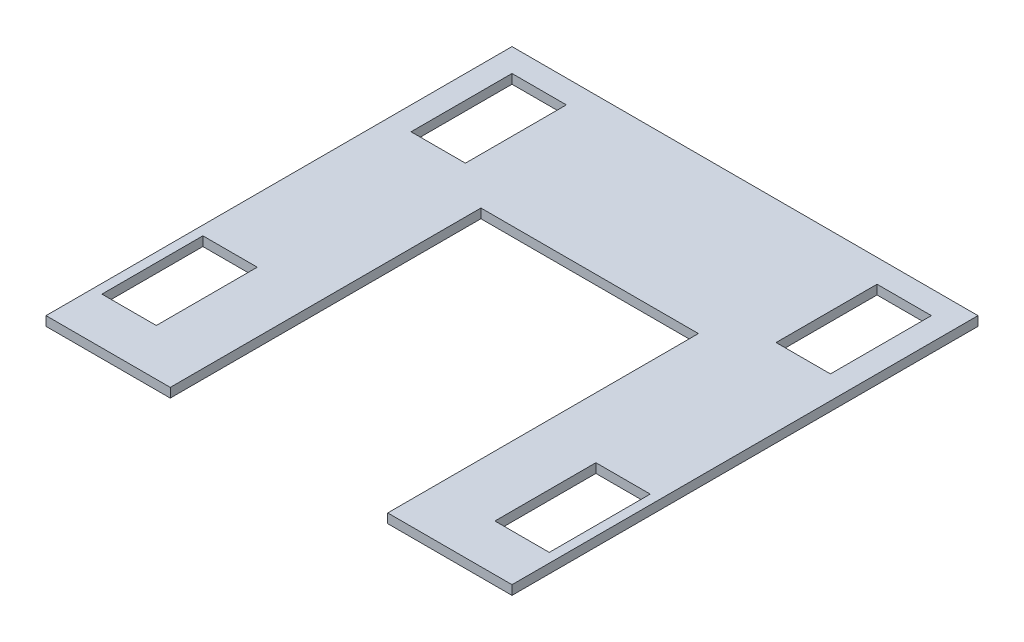
ISO-10303-21;
HEADER;
FILE_DESCRIPTION(('STEP AP214'),'2;1');
FILE_NAME('part.step','',(''),(''),'','','');
FILE_SCHEMA(('AUTOMOTIVE_DESIGN { 1 0 10303 214 1 1 1 1 }'));
ENDSEC;
DATA;
#1=APPLICATION_CONTEXT('core data for automotive mechanical design processes');
#2=APPLICATION_PROTOCOL_DEFINITION('international standard','automotive_design',2000,#1);
#3=PRODUCT_CONTEXT('',#1,'mechanical');
#4=PRODUCT('Part','Part','',(#3));
#5=PRODUCT_RELATED_PRODUCT_CATEGORY('part','',(#4));
#6=PRODUCT_DEFINITION_FORMATION('','',#4);
#7=PRODUCT_DEFINITION_CONTEXT('part definition',#1,'design');
#8=PRODUCT_DEFINITION('design','',#6,#7);
#9=PRODUCT_DEFINITION_SHAPE('','',#8);
#10=(LENGTH_UNIT() NAMED_UNIT(*) SI_UNIT(.MILLI.,.METRE.));
#11=(NAMED_UNIT(*) PLANE_ANGLE_UNIT() SI_UNIT($,.RADIAN.));
#12=(NAMED_UNIT(*) SI_UNIT($,.STERADIAN.) SOLID_ANGLE_UNIT());
#13=UNCERTAINTY_MEASURE_WITH_UNIT(LENGTH_MEASURE(1.E-05),#10,'distance_accuracy_value','');
#14=(GEOMETRIC_REPRESENTATION_CONTEXT(3) GLOBAL_UNCERTAINTY_ASSIGNED_CONTEXT((#13)) GLOBAL_UNIT_ASSIGNED_CONTEXT((#10,
#11,#12)) REPRESENTATION_CONTEXT('',''));
#15=CARTESIAN_POINT('',(0.,0.,0.));
#16=DIRECTION('',(0.,0.,1.));
#17=DIRECTION('',(1.,0.,0.));
#18=AXIS2_PLACEMENT_3D('',#15,#16,#17);
#19=CARTESIAN_POINT('',(0.,6.,0.));
#20=DIRECTION('',(0.,-1.,0.));
#21=DIRECTION('',(0.,0.,-1.));
#22=AXIS2_PLACEMENT_3D('',#19,#20,#21);
#23=PLANE('',#22);
#24=DIRECTION('',(0.,0.,1.));
#25=VECTOR('',#24,1.);
#26=CARTESIAN_POINT('',(6.,6.,-30.));
#27=LINE('',#26,#25);
#28=CARTESIAN_POINT('',(5.99999999999999,6.,-95.));
#29=VERTEX_POINT('',#28);
#30=CARTESIAN_POINT('',(6.,6.,-30.));
#31=VERTEX_POINT('',#30);
#32=EDGE_CURVE('E233',#29,#31,#27,.T.);
#33=ORIENTED_EDGE('',*,*,#32,.F.);
#34=DIRECTION('',(-1.,0.,0.));
#35=VECTOR('',#34,1.);
#36=CARTESIAN_POINT('',(5.99999999999999,6.,-95.));
#37=LINE('',#36,#35);
#38=CARTESIAN_POINT('',(41.,6.,-95.));
#39=VERTEX_POINT('',#38);
#40=EDGE_CURVE('E241',#39,#29,#37,.T.);
#41=ORIENTED_EDGE('',*,*,#40,.F.);
#42=DIRECTION('',(0.,0.,-1.));
#43=VECTOR('',#42,1.);
#44=CARTESIAN_POINT('',(41.,6.,-30.));
#45=LINE('',#44,#43);
#46=CARTESIAN_POINT('',(41.,6.,-30.));
#47=VERTEX_POINT('',#46);
#48=EDGE_CURVE('E238',#47,#39,#45,.T.);
#49=ORIENTED_EDGE('',*,*,#48,.F.);
#50=DIRECTION('',(1.,0.,0.));
#51=VECTOR('',#50,1.);
#52=CARTESIAN_POINT('',(6.,6.,-30.));
#53=LINE('',#52,#51);
#54=EDGE_CURVE('E235',#31,#47,#53,.T.);
#55=ORIENTED_EDGE('',*,*,#54,.F.);
#56=EDGE_LOOP('',(#33,#41,#49,#55));
#57=FACE_BOUND('',#56,.T.);
#58=DIRECTION('',(0.,0.,1.));
#59=VECTOR('',#58,1.);
#60=CARTESIAN_POINT('',(15.,6.,-285.));
#61=LINE('',#60,#59);
#62=CARTESIAN_POINT('',(15.,6.,-285.));
#63=VERTEX_POINT('',#62);
#64=CARTESIAN_POINT('',(15.,6.,-220.));
#65=VERTEX_POINT('',#64);
#66=EDGE_CURVE('E295',#63,#65,#61,.T.);
#67=ORIENTED_EDGE('',*,*,#66,.F.);
#68=DIRECTION('',(-1.,0.,0.));
#69=VECTOR('',#68,1.);
#70=CARTESIAN_POINT('',(15.,6.,-285.));
#71=LINE('',#70,#69);
#72=CARTESIAN_POINT('',(50.,6.,-285.));
#73=VERTEX_POINT('',#72);
#74=EDGE_CURVE('E303',#73,#63,#71,.T.);
#75=ORIENTED_EDGE('',*,*,#74,.F.);
#76=DIRECTION('',(0.,0.,-1.));
#77=VECTOR('',#76,1.);
#78=CARTESIAN_POINT('',(50.,6.,-285.));
#79=LINE('',#78,#77);
#80=CARTESIAN_POINT('',(50.,6.,-220.));
#81=VERTEX_POINT('',#80);
#82=EDGE_CURVE('E300',#81,#73,#79,.T.);
#83=ORIENTED_EDGE('',*,*,#82,.F.);
#84=DIRECTION('',(1.,0.,0.));
#85=VECTOR('',#84,1.);
#86=CARTESIAN_POINT('',(15.,6.,-220.));
#87=LINE('',#86,#85);
#88=EDGE_CURVE('E297',#65,#81,#87,.T.);
#89=ORIENTED_EDGE('',*,*,#88,.F.);
#90=EDGE_LOOP('',(#67,#75,#83,#89));
#91=FACE_BOUND('',#90,.T.);
#92=DIRECTION('',(0.,0.,1.));
#93=VECTOR('',#92,1.);
#94=CARTESIAN_POINT('',(0.,6.,0.));
#95=LINE('',#94,#93);
#96=CARTESIAN_POINT('',(0.,6.,-300.));
#97=VERTEX_POINT('',#96);
#98=CARTESIAN_POINT('',(0.,6.,0.));
#99=VERTEX_POINT('',#98);
#100=EDGE_CURVE('E326',#97,#99,#95,.T.);
#101=ORIENTED_EDGE('',*,*,#100,.T.);
#102=DIRECTION('',(1.,0.,0.));
#103=VECTOR('',#102,1.);
#104=CARTESIAN_POINT('',(0.,6.,0.));
#105=LINE('',#104,#103);
#106=CARTESIAN_POINT('',(80.,6.,0.));
#107=VERTEX_POINT('',#106);
#108=EDGE_CURVE('E329',#99,#107,#105,.T.);
#109=ORIENTED_EDGE('',*,*,#108,.T.);
#110=DIRECTION('',(0.,0.,-1.));
#111=VECTOR('',#110,1.);
#112=CARTESIAN_POINT('',(80.,6.,0.));
#113=LINE('',#112,#111);
#114=CARTESIAN_POINT('',(80.,6.,-200.));
#115=VERTEX_POINT('',#114);
#116=EDGE_CURVE('E332',#107,#115,#113,.T.);
#117=ORIENTED_EDGE('',*,*,#116,.T.);
#118=DIRECTION('',(1.,0.,0.));
#119=VECTOR('',#118,1.);
#120=CARTESIAN_POINT('',(80.,6.,-200.));
#121=LINE('',#120,#119);
#122=CARTESIAN_POINT('',(220.,6.,-200.));
#123=VERTEX_POINT('',#122);
#124=EDGE_CURVE('E334',#115,#123,#121,.T.);
#125=ORIENTED_EDGE('',*,*,#124,.T.);
#126=DIRECTION('',(0.,0.,1.));
#127=VECTOR('',#126,1.);
#128=CARTESIAN_POINT('',(220.,6.,-200.));
#129=LINE('',#128,#127);
#130=CARTESIAN_POINT('',(220.,6.,0.));
#131=VERTEX_POINT('',#130);
#132=EDGE_CURVE('E336',#123,#131,#129,.T.);
#133=ORIENTED_EDGE('',*,*,#132,.T.);
#134=DIRECTION('',(1.,0.,0.));
#135=VECTOR('',#134,1.);
#136=CARTESIAN_POINT('',(220.,6.,0.));
#137=LINE('',#136,#135);
#138=CARTESIAN_POINT('',(300.,6.,0.));
#139=VERTEX_POINT('',#138);
#140=EDGE_CURVE('E338',#131,#139,#137,.T.);
#141=ORIENTED_EDGE('',*,*,#140,.T.);
#142=DIRECTION('',(0.,0.,-1.));
#143=VECTOR('',#142,1.);
#144=CARTESIAN_POINT('',(300.,6.,0.));
#145=LINE('',#144,#143);
#146=CARTESIAN_POINT('',(300.,6.,-300.));
#147=VERTEX_POINT('',#146);
#148=EDGE_CURVE('E340',#139,#147,#145,.T.);
#149=ORIENTED_EDGE('',*,*,#148,.T.);
#150=DIRECTION('',(-1.,0.,0.));
#151=VECTOR('',#150,1.);
#152=CARTESIAN_POINT('',(0.,6.,-300.));
#153=LINE('',#152,#151);
#154=EDGE_CURVE('E342',#147,#97,#153,.T.);
#155=ORIENTED_EDGE('',*,*,#154,.T.);
#156=EDGE_LOOP('',(#101,#109,#117,#125,#133,#141,#149,#155));
#157=FACE_BOUND('',#156,.T.);
#158=DIRECTION('',(0.,0.,1.));
#159=VECTOR('',#158,1.);
#160=CARTESIAN_POINT('',(250.,6.,-285.));
#161=LINE('',#160,#159);
#162=CARTESIAN_POINT('',(250.,6.,-285.));
#163=VERTEX_POINT('',#162);
#164=CARTESIAN_POINT('',(250.,6.,-220.));
#165=VERTEX_POINT('',#164);
#166=EDGE_CURVE('E264',#163,#165,#161,.T.);
#167=ORIENTED_EDGE('',*,*,#166,.F.);
#168=DIRECTION('',(-1.,0.,0.));
#169=VECTOR('',#168,1.);
#170=CARTESIAN_POINT('',(250.,6.,-285.));
#171=LINE('',#170,#169);
#172=CARTESIAN_POINT('',(285.,6.,-285.));
#173=VERTEX_POINT('',#172);
#174=EDGE_CURVE('E272',#173,#163,#171,.T.);
#175=ORIENTED_EDGE('',*,*,#174,.F.);
#176=DIRECTION('',(0.,0.,-1.));
#177=VECTOR('',#176,1.);
#178=CARTESIAN_POINT('',(285.,6.,-285.));
#179=LINE('',#178,#177);
#180=CARTESIAN_POINT('',(285.,6.,-220.));
#181=VERTEX_POINT('',#180);
#182=EDGE_CURVE('E269',#181,#173,#179,.T.);
#183=ORIENTED_EDGE('',*,*,#182,.F.);
#184=DIRECTION('',(1.,0.,0.));
#185=VECTOR('',#184,1.);
#186=CARTESIAN_POINT('',(250.,6.,-220.));
#187=LINE('',#186,#185);
#188=EDGE_CURVE('E266',#165,#181,#187,.T.);
#189=ORIENTED_EDGE('',*,*,#188,.F.);
#190=EDGE_LOOP('',(#167,#175,#183,#189));
#191=FACE_BOUND('',#190,.T.);
#192=DIRECTION('',(0.,0.,-1.));
#193=VECTOR('',#192,1.);
#194=CARTESIAN_POINT('',(294.,6.,-30.));
#195=LINE('',#194,#193);
#196=CARTESIAN_POINT('',(294.,6.,-30.));
#197=VERTEX_POINT('',#196);
#198=CARTESIAN_POINT('',(294.,6.,-95.));
#199=VERTEX_POINT('',#198);
#200=EDGE_CURVE('E197',#197,#199,#195,.T.);
#201=ORIENTED_EDGE('',*,*,#200,.F.);
#202=DIRECTION('',(1.,0.,0.));
#203=VECTOR('',#202,1.);
#204=CARTESIAN_POINT('',(294.,6.,-30.));
#205=LINE('',#204,#203);
#206=CARTESIAN_POINT('',(259.,6.,-30.));
#207=VERTEX_POINT('',#206);
#208=EDGE_CURVE('E219',#207,#197,#205,.T.);
#209=ORIENTED_EDGE('',*,*,#208,.F.);
#210=DIRECTION('',(0.,0.,1.));
#211=VECTOR('',#210,1.);
#212=CARTESIAN_POINT('',(259.,6.,-30.));
#213=LINE('',#212,#211);
#214=CARTESIAN_POINT('',(259.,6.,-95.));
#215=VERTEX_POINT('',#214);
#216=EDGE_CURVE('E217',#215,#207,#213,.T.);
#217=ORIENTED_EDGE('',*,*,#216,.F.);
#218=DIRECTION('',(-1.,0.,0.));
#219=VECTOR('',#218,1.);
#220=CARTESIAN_POINT('',(294.,6.,-95.));
#221=LINE('',#220,#219);
#222=EDGE_CURVE('E205',#199,#215,#221,.T.);
#223=ORIENTED_EDGE('',*,*,#222,.F.);
#224=EDGE_LOOP('',(#201,#209,#217,#223));
#225=FACE_BOUND('',#224,.T.);
#226=ADVANCED_FACE('F36',(#57,#91,#157,#191,#225),#23,.F.);
#227=CARTESIAN_POINT('',(0.,0.,0.));
#228=DIRECTION('',(0.,-1.,0.));
#229=DIRECTION('',(0.,0.,-1.));
#230=AXIS2_PLACEMENT_3D('',#227,#228,#229);
#231=PLANE('',#230);
#232=DIRECTION('',(0.,0.,1.));
#233=VECTOR('',#232,1.);
#234=CARTESIAN_POINT('',(0.,0.,0.));
#235=LINE('',#234,#233);
#236=CARTESIAN_POINT('',(0.,0.,-300.));
#237=VERTEX_POINT('',#236);
#238=CARTESIAN_POINT('',(0.,0.,0.));
#239=VERTEX_POINT('',#238);
#240=EDGE_CURVE('E325',#237,#239,#235,.T.);
#241=ORIENTED_EDGE('',*,*,#240,.F.);
#242=DIRECTION('',(-1.,0.,0.));
#243=VECTOR('',#242,1.);
#244=CARTESIAN_POINT('',(0.,0.,-300.));
#245=LINE('',#244,#243);
#246=CARTESIAN_POINT('',(300.,0.,-300.));
#247=VERTEX_POINT('',#246);
#248=EDGE_CURVE('E330',#247,#237,#245,.T.);
#249=ORIENTED_EDGE('',*,*,#248,.F.);
#250=DIRECTION('',(0.,0.,-1.));
#251=VECTOR('',#250,1.);
#252=CARTESIAN_POINT('',(300.,0.,0.));
#253=LINE('',#252,#251);
#254=CARTESIAN_POINT('',(300.,0.,0.));
#255=VERTEX_POINT('',#254);
#256=EDGE_CURVE('E357',#255,#247,#253,.T.);
#257=ORIENTED_EDGE('',*,*,#256,.F.);
#258=DIRECTION('',(1.,0.,0.));
#259=VECTOR('',#258,1.);
#260=CARTESIAN_POINT('',(220.,0.,0.));
#261=LINE('',#260,#259);
#262=CARTESIAN_POINT('',(220.,0.,0.));
#263=VERTEX_POINT('',#262);
#264=EDGE_CURVE('E355',#263,#255,#261,.T.);
#265=ORIENTED_EDGE('',*,*,#264,.F.);
#266=DIRECTION('',(0.,0.,1.));
#267=VECTOR('',#266,1.);
#268=CARTESIAN_POINT('',(220.,0.,-200.));
#269=LINE('',#268,#267);
#270=CARTESIAN_POINT('',(220.,0.,-200.));
#271=VERTEX_POINT('',#270);
#272=EDGE_CURVE('E353',#271,#263,#269,.T.);
#273=ORIENTED_EDGE('',*,*,#272,.F.);
#274=DIRECTION('',(1.,0.,0.));
#275=VECTOR('',#274,1.);
#276=CARTESIAN_POINT('',(80.,0.,-200.));
#277=LINE('',#276,#275);
#278=CARTESIAN_POINT('',(80.,0.,-200.));
#279=VERTEX_POINT('',#278);
#280=EDGE_CURVE('E351',#279,#271,#277,.T.);
#281=ORIENTED_EDGE('',*,*,#280,.F.);
#282=DIRECTION('',(0.,0.,-1.));
#283=VECTOR('',#282,1.);
#284=CARTESIAN_POINT('',(80.,0.,0.));
#285=LINE('',#284,#283);
#286=CARTESIAN_POINT('',(80.,0.,0.));
#287=VERTEX_POINT('',#286);
#288=EDGE_CURVE('E349',#287,#279,#285,.T.);
#289=ORIENTED_EDGE('',*,*,#288,.F.);
#290=DIRECTION('',(1.,0.,0.));
#291=VECTOR('',#290,1.);
#292=CARTESIAN_POINT('',(0.,0.,0.));
#293=LINE('',#292,#291);
#294=EDGE_CURVE('E347',#239,#287,#293,.T.);
#295=ORIENTED_EDGE('',*,*,#294,.F.);
#296=EDGE_LOOP('',(#241,#249,#257,#265,#273,#281,#289,#295));
#297=FACE_BOUND('',#296,.T.);
#298=DIRECTION('',(-1.,0.,0.));
#299=VECTOR('',#298,1.);
#300=CARTESIAN_POINT('',(15.,0.,-285.));
#301=LINE('',#300,#299);
#302=CARTESIAN_POINT('',(50.,0.,-285.));
#303=VERTEX_POINT('',#302);
#304=CARTESIAN_POINT('',(15.,0.,-285.));
#305=VERTEX_POINT('',#304);
#306=EDGE_CURVE('E298',#303,#305,#301,.T.);
#307=ORIENTED_EDGE('',*,*,#306,.T.);
#308=DIRECTION('',(0.,0.,1.));
#309=VECTOR('',#308,1.);
#310=CARTESIAN_POINT('',(15.,0.,-285.));
#311=LINE('',#310,#309);
#312=CARTESIAN_POINT('',(15.,0.,-220.));
#313=VERTEX_POINT('',#312);
#314=EDGE_CURVE('E294',#305,#313,#311,.T.);
#315=ORIENTED_EDGE('',*,*,#314,.T.);
#316=DIRECTION('',(1.,0.,0.));
#317=VECTOR('',#316,1.);
#318=CARTESIAN_POINT('',(15.,0.,-220.));
#319=LINE('',#318,#317);
#320=CARTESIAN_POINT('',(50.,0.,-220.));
#321=VERTEX_POINT('',#320);
#322=EDGE_CURVE('E308',#313,#321,#319,.T.);
#323=ORIENTED_EDGE('',*,*,#322,.T.);
#324=DIRECTION('',(0.,0.,-1.));
#325=VECTOR('',#324,1.);
#326=CARTESIAN_POINT('',(50.,0.,-285.));
#327=LINE('',#326,#325);
#328=EDGE_CURVE('E311',#321,#303,#327,.T.);
#329=ORIENTED_EDGE('',*,*,#328,.T.);
#330=EDGE_LOOP('',(#307,#315,#323,#329));
#331=FACE_BOUND('',#330,.T.);
#332=DIRECTION('',(-1.,0.,0.));
#333=VECTOR('',#332,1.);
#334=CARTESIAN_POINT('',(250.,0.,-285.));
#335=LINE('',#334,#333);
#336=CARTESIAN_POINT('',(285.,0.,-285.));
#337=VERTEX_POINT('',#336);
#338=CARTESIAN_POINT('',(250.,0.,-285.));
#339=VERTEX_POINT('',#338);
#340=EDGE_CURVE('E267',#337,#339,#335,.T.);
#341=ORIENTED_EDGE('',*,*,#340,.T.);
#342=DIRECTION('',(0.,0.,1.));
#343=VECTOR('',#342,1.);
#344=CARTESIAN_POINT('',(250.,0.,-285.));
#345=LINE('',#344,#343);
#346=CARTESIAN_POINT('',(250.,0.,-220.));
#347=VERTEX_POINT('',#346);
#348=EDGE_CURVE('E263',#339,#347,#345,.T.);
#349=ORIENTED_EDGE('',*,*,#348,.T.);
#350=DIRECTION('',(1.,0.,0.));
#351=VECTOR('',#350,1.);
#352=CARTESIAN_POINT('',(250.,0.,-220.));
#353=LINE('',#352,#351);
#354=CARTESIAN_POINT('',(285.,0.,-220.));
#355=VERTEX_POINT('',#354);
#356=EDGE_CURVE('E277',#347,#355,#353,.T.);
#357=ORIENTED_EDGE('',*,*,#356,.T.);
#358=DIRECTION('',(0.,0.,-1.));
#359=VECTOR('',#358,1.);
#360=CARTESIAN_POINT('',(285.,0.,-285.));
#361=LINE('',#360,#359);
#362=EDGE_CURVE('E280',#355,#337,#361,.T.);
#363=ORIENTED_EDGE('',*,*,#362,.T.);
#364=EDGE_LOOP('',(#341,#349,#357,#363));
#365=FACE_BOUND('',#364,.T.);
#366=DIRECTION('',(-1.,0.,0.));
#367=VECTOR('',#366,1.);
#368=CARTESIAN_POINT('',(5.99999999999999,0.,-95.));
#369=LINE('',#368,#367);
#370=CARTESIAN_POINT('',(41.,0.,-95.));
#371=VERTEX_POINT('',#370);
#372=CARTESIAN_POINT('',(5.99999999999999,0.,-95.));
#373=VERTEX_POINT('',#372);
#374=EDGE_CURVE('E236',#371,#373,#369,.T.);
#375=ORIENTED_EDGE('',*,*,#374,.T.);
#376=DIRECTION('',(0.,0.,1.));
#377=VECTOR('',#376,1.);
#378=CARTESIAN_POINT('',(6.,0.,-30.));
#379=LINE('',#378,#377);
#380=CARTESIAN_POINT('',(6.,0.,-30.));
#381=VERTEX_POINT('',#380);
#382=EDGE_CURVE('E213',#373,#381,#379,.T.);
#383=ORIENTED_EDGE('',*,*,#382,.T.);
#384=DIRECTION('',(1.,0.,0.));
#385=VECTOR('',#384,1.);
#386=CARTESIAN_POINT('',(6.,0.,-30.));
#387=LINE('',#386,#385);
#388=CARTESIAN_POINT('',(41.,0.,-30.));
#389=VERTEX_POINT('',#388);
#390=EDGE_CURVE('E246',#381,#389,#387,.T.);
#391=ORIENTED_EDGE('',*,*,#390,.T.);
#392=DIRECTION('',(0.,0.,-1.));
#393=VECTOR('',#392,1.);
#394=CARTESIAN_POINT('',(41.,0.,-30.));
#395=LINE('',#394,#393);
#396=EDGE_CURVE('E249',#389,#371,#395,.T.);
#397=ORIENTED_EDGE('',*,*,#396,.T.);
#398=EDGE_LOOP('',(#375,#383,#391,#397));
#399=FACE_BOUND('',#398,.T.);
#400=DIRECTION('',(1.,0.,0.));
#401=VECTOR('',#400,1.);
#402=CARTESIAN_POINT('',(294.,0.,-30.));
#403=LINE('',#402,#401);
#404=CARTESIAN_POINT('',(259.,0.,-30.));
#405=VERTEX_POINT('',#404);
#406=CARTESIAN_POINT('',(294.,0.,-30.));
#407=VERTEX_POINT('',#406);
#408=EDGE_CURVE('E206',#405,#407,#403,.T.);
#409=ORIENTED_EDGE('',*,*,#408,.T.);
#410=DIRECTION('',(0.,0.,-1.));
#411=VECTOR('',#410,1.);
#412=CARTESIAN_POINT('',(294.,0.,-30.));
#413=LINE('',#412,#411);
#414=CARTESIAN_POINT('',(294.,0.,-95.));
#415=VERTEX_POINT('',#414);
#416=EDGE_CURVE('E59',#407,#415,#413,.T.);
#417=ORIENTED_EDGE('',*,*,#416,.T.);
#418=DIRECTION('',(-1.,0.,0.));
#419=VECTOR('',#418,1.);
#420=CARTESIAN_POINT('',(294.,0.,-95.));
#421=LINE('',#420,#419);
#422=CARTESIAN_POINT('',(259.,0.,-95.));
#423=VERTEX_POINT('',#422);
#424=EDGE_CURVE('E212',#415,#423,#421,.T.);
#425=ORIENTED_EDGE('',*,*,#424,.T.);
#426=DIRECTION('',(0.,0.,1.));
#427=VECTOR('',#426,1.);
#428=CARTESIAN_POINT('',(259.,0.,-30.));
#429=LINE('',#428,#427);
#430=EDGE_CURVE('E225',#423,#405,#429,.T.);
#431=ORIENTED_EDGE('',*,*,#430,.T.);
#432=EDGE_LOOP('',(#409,#417,#425,#431));
#433=FACE_BOUND('',#432,.T.);
#434=ADVANCED_FACE('F387',(#297,#331,#365,#399,#433),#231,.T.);
#435=CARTESIAN_POINT('',(0.,6.,0.));
#436=DIRECTION('',(1.,0.,0.));
#437=DIRECTION('',(0.,0.,-1.));
#438=AXIS2_PLACEMENT_3D('',#435,#436,#437);
#439=PLANE('',#438);
#440=ORIENTED_EDGE('',*,*,#240,.T.);
#441=DIRECTION('',(0.,-1.,0.));
#442=VECTOR('',#441,1.);
#443=CARTESIAN_POINT('',(0.,6.,0.));
#444=LINE('',#443,#442);
#445=EDGE_CURVE('E11',#99,#239,#444,.T.);
#446=ORIENTED_EDGE('',*,*,#445,.F.);
#447=ORIENTED_EDGE('',*,*,#100,.F.);
#448=DIRECTION('',(0.,-1.,0.));
#449=VECTOR('',#448,1.);
#450=CARTESIAN_POINT('',(0.,6.,-300.));
#451=LINE('',#450,#449);
#452=EDGE_CURVE('E344',#97,#237,#451,.T.);
#453=ORIENTED_EDGE('',*,*,#452,.T.);
#454=EDGE_LOOP('',(#440,#446,#447,#453));
#455=FACE_BOUND('',#454,.T.);
#456=ADVANCED_FACE('F38',(#455),#439,.F.);
#457=CARTESIAN_POINT('',(0.,6.,0.));
#458=DIRECTION('',(0.,0.,-1.));
#459=DIRECTION('',(-1.,0.,0.));
#460=AXIS2_PLACEMENT_3D('',#457,#458,#459);
#461=PLANE('',#460);
#462=ORIENTED_EDGE('',*,*,#294,.T.);
#463=DIRECTION('',(0.,-1.,0.));
#464=VECTOR('',#463,1.);
#465=CARTESIAN_POINT('',(80.,6.,0.));
#466=LINE('',#465,#464);
#467=EDGE_CURVE('E44',#107,#287,#466,.T.);
#468=ORIENTED_EDGE('',*,*,#467,.F.);
#469=ORIENTED_EDGE('',*,*,#108,.F.);
#470=ORIENTED_EDGE('',*,*,#445,.T.);
#471=EDGE_LOOP('',(#462,#468,#469,#470));
#472=FACE_BOUND('',#471,.T.);
#473=ADVANCED_FACE('F405',(#472),#461,.F.);
#474=CARTESIAN_POINT('',(80.,6.,0.));
#475=DIRECTION('',(-1.,0.,0.));
#476=DIRECTION('',(0.,0.,1.));
#477=AXIS2_PLACEMENT_3D('',#474,#475,#476);
#478=PLANE('',#477);
#479=ORIENTED_EDGE('',*,*,#288,.T.);
#480=DIRECTION('',(0.,-1.,0.));
#481=VECTOR('',#480,1.);
#482=CARTESIAN_POINT('',(80.,6.,-200.));
#483=LINE('',#482,#481);
#484=EDGE_CURVE('E374',#115,#279,#483,.T.);
#485=ORIENTED_EDGE('',*,*,#484,.F.);
#486=ORIENTED_EDGE('',*,*,#116,.F.);
#487=ORIENTED_EDGE('',*,*,#467,.T.);
#488=EDGE_LOOP('',(#479,#485,#486,#487));
#489=FACE_BOUND('',#488,.T.);
#490=ADVANCED_FACE('F381',(#489),#478,.F.);
#491=CARTESIAN_POINT('',(80.,6.,-200.));
#492=DIRECTION('',(0.,0.,-1.));
#493=DIRECTION('',(-1.,0.,0.));
#494=AXIS2_PLACEMENT_3D('',#491,#492,#493);
#495=PLANE('',#494);
#496=ORIENTED_EDGE('',*,*,#280,.T.);
#497=DIRECTION('',(0.,-1.,0.));
#498=VECTOR('',#497,1.);
#499=CARTESIAN_POINT('',(220.,6.,-200.));
#500=LINE('',#499,#498);
#501=EDGE_CURVE('E371',#123,#271,#500,.T.);
#502=ORIENTED_EDGE('',*,*,#501,.F.);
#503=ORIENTED_EDGE('',*,*,#124,.F.);
#504=ORIENTED_EDGE('',*,*,#484,.T.);
#505=EDGE_LOOP('',(#496,#502,#503,#504));
#506=FACE_BOUND('',#505,.T.);
#507=ADVANCED_FACE('F393',(#506),#495,.F.);
#508=CARTESIAN_POINT('',(220.,6.,-200.));
#509=DIRECTION('',(1.,0.,0.));
#510=DIRECTION('',(0.,0.,-1.));
#511=AXIS2_PLACEMENT_3D('',#508,#509,#510);
#512=PLANE('',#511);
#513=ORIENTED_EDGE('',*,*,#272,.T.);
#514=DIRECTION('',(0.,-1.,0.));
#515=VECTOR('',#514,1.);
#516=CARTESIAN_POINT('',(220.,6.,0.));
#517=LINE('',#516,#515);
#518=EDGE_CURVE('E368',#131,#263,#517,.T.);
#519=ORIENTED_EDGE('',*,*,#518,.F.);
#520=ORIENTED_EDGE('',*,*,#132,.F.);
#521=ORIENTED_EDGE('',*,*,#501,.T.);
#522=EDGE_LOOP('',(#513,#519,#520,#521));
#523=FACE_BOUND('',#522,.T.);
#524=ADVANCED_FACE('F397',(#523),#512,.F.);
#525=CARTESIAN_POINT('',(220.,6.,0.));
#526=DIRECTION('',(0.,0.,-1.));
#527=DIRECTION('',(-1.,0.,0.));
#528=AXIS2_PLACEMENT_3D('',#525,#526,#527);
#529=PLANE('',#528);
#530=ORIENTED_EDGE('',*,*,#264,.T.);
#531=DIRECTION('',(0.,-1.,0.));
#532=VECTOR('',#531,1.);
#533=CARTESIAN_POINT('',(300.,6.,0.));
#534=LINE('',#533,#532);
#535=EDGE_CURVE('E365',#139,#255,#534,.T.);
#536=ORIENTED_EDGE('',*,*,#535,.F.);
#537=ORIENTED_EDGE('',*,*,#140,.F.);
#538=ORIENTED_EDGE('',*,*,#518,.T.);
#539=EDGE_LOOP('',(#530,#536,#537,#538));
#540=FACE_BOUND('',#539,.T.);
#541=ADVANCED_FACE('F418',(#540),#529,.F.);
#542=CARTESIAN_POINT('',(300.,6.,0.));
#543=DIRECTION('',(-1.,0.,0.));
#544=DIRECTION('',(0.,0.,1.));
#545=AXIS2_PLACEMENT_3D('',#542,#543,#544);
#546=PLANE('',#545);
#547=ORIENTED_EDGE('',*,*,#256,.T.);
#548=DIRECTION('',(0.,-1.,0.));
#549=VECTOR('',#548,1.);
#550=CARTESIAN_POINT('',(300.,6.,-300.));
#551=LINE('',#550,#549);
#552=EDGE_CURVE('E362',#147,#247,#551,.T.);
#553=ORIENTED_EDGE('',*,*,#552,.F.);
#554=ORIENTED_EDGE('',*,*,#148,.F.);
#555=ORIENTED_EDGE('',*,*,#535,.T.);
#556=EDGE_LOOP('',(#547,#553,#554,#555));
#557=FACE_BOUND('',#556,.T.);
#558=ADVANCED_FACE('F416',(#557),#546,.F.);
#559=CARTESIAN_POINT('',(0.,6.,-300.));
#560=DIRECTION('',(0.,0.,1.));
#561=DIRECTION('',(1.,0.,0.));
#562=AXIS2_PLACEMENT_3D('',#559,#560,#561);
#563=PLANE('',#562);
#564=ORIENTED_EDGE('',*,*,#248,.T.);
#565=ORIENTED_EDGE('',*,*,#452,.F.);
#566=ORIENTED_EDGE('',*,*,#154,.F.);
#567=ORIENTED_EDGE('',*,*,#552,.T.);
#568=EDGE_LOOP('',(#564,#565,#566,#567));
#569=FACE_BOUND('',#568,.T.);
#570=ADVANCED_FACE('F411',(#569),#563,.F.);
#571=CARTESIAN_POINT('',(15.,6.,-285.));
#572=DIRECTION('',(1.,0.,0.));
#573=DIRECTION('',(0.,0.,-1.));
#574=AXIS2_PLACEMENT_3D('',#571,#572,#573);
#575=PLANE('',#574);
#576=ORIENTED_EDGE('',*,*,#314,.F.);
#577=DIRECTION('',(0.,-1.,0.));
#578=VECTOR('',#577,1.);
#579=CARTESIAN_POINT('',(15.,6.,-285.));
#580=LINE('',#579,#578);
#581=EDGE_CURVE('E305',#63,#305,#580,.T.);
#582=ORIENTED_EDGE('',*,*,#581,.F.);
#583=ORIENTED_EDGE('',*,*,#66,.T.);
#584=DIRECTION('',(0.,-1.,0.));
#585=VECTOR('',#584,1.);
#586=CARTESIAN_POINT('',(15.,6.,-220.));
#587=LINE('',#586,#585);
#588=EDGE_CURVE('E322',#65,#313,#587,.T.);
#589=ORIENTED_EDGE('',*,*,#588,.T.);
#590=EDGE_LOOP('',(#576,#582,#583,#589));
#591=FACE_BOUND('',#590,.T.);
#592=ADVANCED_FACE('F437',(#591),#575,.T.);
#593=CARTESIAN_POINT('',(15.,6.,-220.));
#594=DIRECTION('',(0.,0.,-1.));
#595=DIRECTION('',(-1.,0.,0.));
#596=AXIS2_PLACEMENT_3D('',#593,#594,#595);
#597=PLANE('',#596);
#598=ORIENTED_EDGE('',*,*,#322,.F.);
#599=ORIENTED_EDGE('',*,*,#588,.F.);
#600=ORIENTED_EDGE('',*,*,#88,.T.);
#601=DIRECTION('',(0.,-1.,0.));
#602=VECTOR('',#601,1.);
#603=CARTESIAN_POINT('',(50.,6.,-220.));
#604=LINE('',#603,#602);
#605=EDGE_CURVE('E320',#81,#321,#604,.T.);
#606=ORIENTED_EDGE('',*,*,#605,.T.);
#607=EDGE_LOOP('',(#598,#599,#600,#606));
#608=FACE_BOUND('',#607,.T.);
#609=ADVANCED_FACE('F444',(#608),#597,.T.);
#610=CARTESIAN_POINT('',(50.,6.,-285.));
#611=DIRECTION('',(-1.,0.,0.));
#612=DIRECTION('',(0.,0.,1.));
#613=AXIS2_PLACEMENT_3D('',#610,#611,#612);
#614=PLANE('',#613);
#615=ORIENTED_EDGE('',*,*,#328,.F.);
#616=ORIENTED_EDGE('',*,*,#605,.F.);
#617=ORIENTED_EDGE('',*,*,#82,.T.);
#618=DIRECTION('',(0.,-1.,0.));
#619=VECTOR('',#618,1.);
#620=CARTESIAN_POINT('',(50.,6.,-285.));
#621=LINE('',#620,#619);
#622=EDGE_CURVE('E318',#73,#303,#621,.T.);
#623=ORIENTED_EDGE('',*,*,#622,.T.);
#624=EDGE_LOOP('',(#615,#616,#617,#623));
#625=FACE_BOUND('',#624,.T.);
#626=ADVANCED_FACE('F449',(#625),#614,.T.);
#627=CARTESIAN_POINT('',(15.,6.,-285.));
#628=DIRECTION('',(0.,0.,1.));
#629=DIRECTION('',(1.,0.,0.));
#630=AXIS2_PLACEMENT_3D('',#627,#628,#629);
#631=PLANE('',#630);
#632=ORIENTED_EDGE('',*,*,#306,.F.);
#633=ORIENTED_EDGE('',*,*,#622,.F.);
#634=ORIENTED_EDGE('',*,*,#74,.T.);
#635=ORIENTED_EDGE('',*,*,#581,.T.);
#636=EDGE_LOOP('',(#632,#633,#634,#635));
#637=FACE_BOUND('',#636,.T.);
#638=ADVANCED_FACE('F456',(#637),#631,.T.);
#639=CARTESIAN_POINT('',(250.,6.,-285.));
#640=DIRECTION('',(1.,0.,0.));
#641=DIRECTION('',(0.,0.,-1.));
#642=AXIS2_PLACEMENT_3D('',#639,#640,#641);
#643=PLANE('',#642);
#644=ORIENTED_EDGE('',*,*,#348,.F.);
#645=DIRECTION('',(0.,-1.,0.));
#646=VECTOR('',#645,1.);
#647=CARTESIAN_POINT('',(250.,6.,-285.));
#648=LINE('',#647,#646);
#649=EDGE_CURVE('E274',#163,#339,#648,.T.);
#650=ORIENTED_EDGE('',*,*,#649,.F.);
#651=ORIENTED_EDGE('',*,*,#166,.T.);
#652=DIRECTION('',(0.,-1.,0.));
#653=VECTOR('',#652,1.);
#654=CARTESIAN_POINT('',(250.,6.,-220.));
#655=LINE('',#654,#653);
#656=EDGE_CURVE('E291',#165,#347,#655,.T.);
#657=ORIENTED_EDGE('',*,*,#656,.T.);
#658=EDGE_LOOP('',(#644,#650,#651,#657));
#659=FACE_BOUND('',#658,.T.);
#660=ADVANCED_FACE('F469',(#659),#643,.T.);
#661=CARTESIAN_POINT('',(250.,6.,-220.));
#662=DIRECTION('',(0.,0.,-1.));
#663=DIRECTION('',(-1.,0.,0.));
#664=AXIS2_PLACEMENT_3D('',#661,#662,#663);
#665=PLANE('',#664);
#666=ORIENTED_EDGE('',*,*,#356,.F.);
#667=ORIENTED_EDGE('',*,*,#656,.F.);
#668=ORIENTED_EDGE('',*,*,#188,.T.);
#669=DIRECTION('',(0.,-1.,0.));
#670=VECTOR('',#669,1.);
#671=CARTESIAN_POINT('',(285.,6.,-220.));
#672=LINE('',#671,#670);
#673=EDGE_CURVE('E289',#181,#355,#672,.T.);
#674=ORIENTED_EDGE('',*,*,#673,.T.);
#675=EDGE_LOOP('',(#666,#667,#668,#674));
#676=FACE_BOUND('',#675,.T.);
#677=ADVANCED_FACE('F474',(#676),#665,.T.);
#678=CARTESIAN_POINT('',(285.,6.,-285.));
#679=DIRECTION('',(-1.,0.,0.));
#680=DIRECTION('',(0.,0.,1.));
#681=AXIS2_PLACEMENT_3D('',#678,#679,#680);
#682=PLANE('',#681);
#683=ORIENTED_EDGE('',*,*,#362,.F.);
#684=ORIENTED_EDGE('',*,*,#673,.F.);
#685=ORIENTED_EDGE('',*,*,#182,.T.);
#686=DIRECTION('',(0.,-1.,0.));
#687=VECTOR('',#686,1.);
#688=CARTESIAN_POINT('',(285.,6.,-285.));
#689=LINE('',#688,#687);
#690=EDGE_CURVE('E287',#173,#337,#689,.T.);
#691=ORIENTED_EDGE('',*,*,#690,.T.);
#692=EDGE_LOOP('',(#683,#684,#685,#691));
#693=FACE_BOUND('',#692,.T.);
#694=ADVANCED_FACE('F478',(#693),#682,.T.);
#695=CARTESIAN_POINT('',(250.,6.,-285.));
#696=DIRECTION('',(0.,0.,1.));
#697=DIRECTION('',(1.,0.,0.));
#698=AXIS2_PLACEMENT_3D('',#695,#696,#697);
#699=PLANE('',#698);
#700=ORIENTED_EDGE('',*,*,#340,.F.);
#701=ORIENTED_EDGE('',*,*,#690,.F.);
#702=ORIENTED_EDGE('',*,*,#174,.T.);
#703=ORIENTED_EDGE('',*,*,#649,.T.);
#704=EDGE_LOOP('',(#700,#701,#702,#703));
#705=FACE_BOUND('',#704,.T.);
#706=ADVANCED_FACE('F482',(#705),#699,.T.);
#707=CARTESIAN_POINT('',(6.,6.,-30.));
#708=DIRECTION('',(1.,0.,0.));
#709=DIRECTION('',(0.,0.,-1.));
#710=AXIS2_PLACEMENT_3D('',#707,#708,#709);
#711=PLANE('',#710);
#712=ORIENTED_EDGE('',*,*,#382,.F.);
#713=DIRECTION('',(0.,-1.,0.));
#714=VECTOR('',#713,1.);
#715=CARTESIAN_POINT('',(5.99999999999999,6.,-95.));
#716=LINE('',#715,#714);
#717=EDGE_CURVE('E243',#29,#373,#716,.T.);
#718=ORIENTED_EDGE('',*,*,#717,.F.);
#719=ORIENTED_EDGE('',*,*,#32,.T.);
#720=DIRECTION('',(0.,-1.,0.));
#721=VECTOR('',#720,1.);
#722=CARTESIAN_POINT('',(6.,6.,-30.));
#723=LINE('',#722,#721);
#724=EDGE_CURVE('E260',#31,#381,#723,.T.);
#725=ORIENTED_EDGE('',*,*,#724,.T.);
#726=EDGE_LOOP('',(#712,#718,#719,#725));
#727=FACE_BOUND('',#726,.T.);
#728=ADVANCED_FACE('F486',(#727),#711,.T.);
#729=CARTESIAN_POINT('',(6.,6.,-30.));
#730=DIRECTION('',(0.,0.,-1.));
#731=DIRECTION('',(-1.,0.,0.));
#732=AXIS2_PLACEMENT_3D('',#729,#730,#731);
#733=PLANE('',#732);
#734=ORIENTED_EDGE('',*,*,#390,.F.);
#735=ORIENTED_EDGE('',*,*,#724,.F.);
#736=ORIENTED_EDGE('',*,*,#54,.T.);
#737=DIRECTION('',(0.,-1.,0.));
#738=VECTOR('',#737,1.);
#739=CARTESIAN_POINT('',(41.,6.,-30.));
#740=LINE('',#739,#738);
#741=EDGE_CURVE('E258',#47,#389,#740,.T.);
#742=ORIENTED_EDGE('',*,*,#741,.T.);
#743=EDGE_LOOP('',(#734,#735,#736,#742));
#744=FACE_BOUND('',#743,.T.);
#745=ADVANCED_FACE('F490',(#744),#733,.T.);
#746=CARTESIAN_POINT('',(41.,6.,-30.));
#747=DIRECTION('',(-1.,0.,0.));
#748=DIRECTION('',(0.,0.,1.));
#749=AXIS2_PLACEMENT_3D('',#746,#747,#748);
#750=PLANE('',#749);
#751=ORIENTED_EDGE('',*,*,#396,.F.);
#752=ORIENTED_EDGE('',*,*,#741,.F.);
#753=ORIENTED_EDGE('',*,*,#48,.T.);
#754=DIRECTION('',(0.,-1.,0.));
#755=VECTOR('',#754,1.);
#756=CARTESIAN_POINT('',(41.,6.,-95.));
#757=LINE('',#756,#755);
#758=EDGE_CURVE('E256',#39,#371,#757,.T.);
#759=ORIENTED_EDGE('',*,*,#758,.T.);
#760=EDGE_LOOP('',(#751,#752,#753,#759));
#761=FACE_BOUND('',#760,.T.);
#762=ADVANCED_FACE('F494',(#761),#750,.T.);
#763=CARTESIAN_POINT('',(5.99999999999999,6.,-95.));
#764=DIRECTION('',(0.,0.,1.));
#765=DIRECTION('',(1.,0.,0.));
#766=AXIS2_PLACEMENT_3D('',#763,#764,#765);
#767=PLANE('',#766);
#768=ORIENTED_EDGE('',*,*,#374,.F.);
#769=ORIENTED_EDGE('',*,*,#758,.F.);
#770=ORIENTED_EDGE('',*,*,#40,.T.);
#771=ORIENTED_EDGE('',*,*,#717,.T.);
#772=EDGE_LOOP('',(#768,#769,#770,#771));
#773=FACE_BOUND('',#772,.T.);
#774=ADVANCED_FACE('F498',(#773),#767,.T.);
#775=CARTESIAN_POINT('',(294.,6.,-30.));
#776=DIRECTION('',(-1.,0.,0.));
#777=DIRECTION('',(0.,0.,1.));
#778=AXIS2_PLACEMENT_3D('',#775,#776,#777);
#779=PLANE('',#778);
#780=ORIENTED_EDGE('',*,*,#416,.F.);
#781=DIRECTION('',(0.,-1.,0.));
#782=VECTOR('',#781,1.);
#783=CARTESIAN_POINT('',(294.,6.,-30.));
#784=LINE('',#783,#782);
#785=EDGE_CURVE('E201',#197,#407,#784,.T.);
#786=ORIENTED_EDGE('',*,*,#785,.F.);
#787=ORIENTED_EDGE('',*,*,#200,.T.);
#788=DIRECTION('',(0.,-1.,0.));
#789=VECTOR('',#788,1.);
#790=CARTESIAN_POINT('',(294.,6.,-95.));
#791=LINE('',#790,#789);
#792=EDGE_CURVE('E200',#199,#415,#791,.T.);
#793=ORIENTED_EDGE('',*,*,#792,.T.);
#794=EDGE_LOOP('',(#780,#786,#787,#793));
#795=FACE_BOUND('',#794,.T.);
#796=ADVANCED_FACE('F199',(#795),#779,.T.);
#797=CARTESIAN_POINT('',(294.,6.,-95.));
#798=DIRECTION('',(0.,0.,1.));
#799=DIRECTION('',(1.,0.,0.));
#800=AXIS2_PLACEMENT_3D('',#797,#798,#799);
#801=PLANE('',#800);
#802=ORIENTED_EDGE('',*,*,#424,.F.);
#803=ORIENTED_EDGE('',*,*,#792,.F.);
#804=ORIENTED_EDGE('',*,*,#222,.T.);
#805=DIRECTION('',(0.,-1.,0.));
#806=VECTOR('',#805,1.);
#807=CARTESIAN_POINT('',(259.,6.,-95.));
#808=LINE('',#807,#806);
#809=EDGE_CURVE('E214',#215,#423,#808,.T.);
#810=ORIENTED_EDGE('',*,*,#809,.T.);
#811=EDGE_LOOP('',(#802,#803,#804,#810));
#812=FACE_BOUND('',#811,.T.);
#813=ADVANCED_FACE('F209',(#812),#801,.T.);
#814=CARTESIAN_POINT('',(259.,6.,-30.));
#815=DIRECTION('',(1.,0.,0.));
#816=DIRECTION('',(0.,0.,-1.));
#817=AXIS2_PLACEMENT_3D('',#814,#815,#816);
#818=PLANE('',#817);
#819=ORIENTED_EDGE('',*,*,#430,.F.);
#820=ORIENTED_EDGE('',*,*,#809,.F.);
#821=ORIENTED_EDGE('',*,*,#216,.T.);
#822=DIRECTION('',(0.,-1.,0.));
#823=VECTOR('',#822,1.);
#824=CARTESIAN_POINT('',(259.,6.,-30.));
#825=LINE('',#824,#823);
#826=EDGE_CURVE('E51',#207,#405,#825,.T.);
#827=ORIENTED_EDGE('',*,*,#826,.T.);
#828=EDGE_LOOP('',(#819,#820,#821,#827));
#829=FACE_BOUND('',#828,.T.);
#830=ADVANCED_FACE('F507',(#829),#818,.T.);
#831=CARTESIAN_POINT('',(294.,6.,-30.));
#832=DIRECTION('',(0.,0.,-1.));
#833=DIRECTION('',(-1.,0.,0.));
#834=AXIS2_PLACEMENT_3D('',#831,#832,#833);
#835=PLANE('',#834);
#836=ORIENTED_EDGE('',*,*,#408,.F.);
#837=ORIENTED_EDGE('',*,*,#826,.F.);
#838=ORIENTED_EDGE('',*,*,#208,.T.);
#839=ORIENTED_EDGE('',*,*,#785,.T.);
#840=EDGE_LOOP('',(#836,#837,#838,#839));
#841=FACE_BOUND('',#840,.T.);
#842=ADVANCED_FACE('F510',(#841),#835,.T.);
#843=CLOSED_SHELL('',(#226,#434,#456,#473,#490,#507,#524,#541,#558,#570,#592,#609,#626,#638,
#660,#677,#694,#706,#728,#745,#762,#774,#796,#813,#830,#842));
#844=MANIFOLD_SOLID_BREP('B2',#843);
#845=ADVANCED_BREP_SHAPE_REPRESENTATION('',(#18,#844),#14);
#846=SHAPE_DEFINITION_REPRESENTATION(#9,#845);
ENDSEC;
END-ISO-10303-21;
